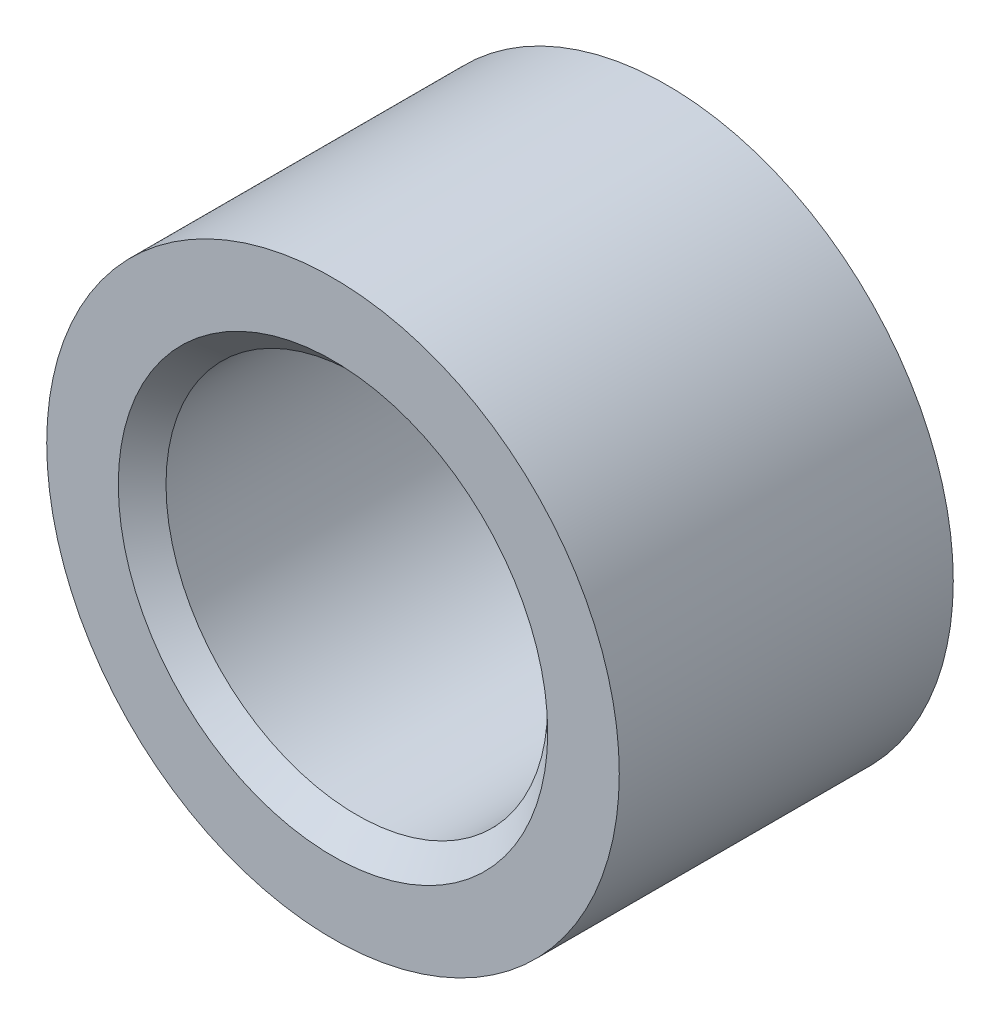
ISO-10303-21;
HEADER;
FILE_DESCRIPTION(('STEP AP214'),'2;1');
FILE_NAME('part.step','',(''),(''),'','','');
FILE_SCHEMA(('AUTOMOTIVE_DESIGN { 1 0 10303 214 1 1 1 1 }'));
ENDSEC;
DATA;
#1=APPLICATION_CONTEXT('core data for automotive mechanical design processes');
#2=APPLICATION_PROTOCOL_DEFINITION('international standard','automotive_design',2000,#1);
#3=PRODUCT_CONTEXT('',#1,'mechanical');
#4=PRODUCT('Part','Part','',(#3));
#5=PRODUCT_RELATED_PRODUCT_CATEGORY('part','',(#4));
#6=PRODUCT_DEFINITION_FORMATION('','',#4);
#7=PRODUCT_DEFINITION_CONTEXT('part definition',#1,'design');
#8=PRODUCT_DEFINITION('design','',#6,#7);
#9=PRODUCT_DEFINITION_SHAPE('','',#8);
#10=(LENGTH_UNIT() NAMED_UNIT(*) SI_UNIT(.MILLI.,.METRE.));
#11=(NAMED_UNIT(*) PLANE_ANGLE_UNIT() SI_UNIT($,.RADIAN.));
#12=(NAMED_UNIT(*) SI_UNIT($,.STERADIAN.) SOLID_ANGLE_UNIT());
#13=UNCERTAINTY_MEASURE_WITH_UNIT(LENGTH_MEASURE(1.E-05),#10,'distance_accuracy_value','');
#14=(GEOMETRIC_REPRESENTATION_CONTEXT(3) GLOBAL_UNCERTAINTY_ASSIGNED_CONTEXT((#13)) GLOBAL_UNIT_ASSIGNED_CONTEXT((#10,
#11,#12)) REPRESENTATION_CONTEXT('',''));
#15=CARTESIAN_POINT('',(0.,0.,0.));
#16=DIRECTION('',(0.,0.,1.));
#17=DIRECTION('',(1.,0.,0.));
#18=AXIS2_PLACEMENT_3D('',#15,#16,#17);
#19=CARTESIAN_POINT('',(0.,0.,3.5));
#20=DIRECTION('',(0.,0.,1.));
#21=DIRECTION('',(1.,0.,0.));
#22=AXIS2_PLACEMENT_3D('',#19,#20,#21);
#23=PLANE('',#22);
#24=CARTESIAN_POINT('',(0.,0.,3.5));
#25=DIRECTION('',(0.,0.,1.));
#26=DIRECTION('',(1.,0.,0.));
#27=AXIS2_PLACEMENT_3D('',#24,#25,#26);
#28=CIRCLE('',#27,4.5);
#29=CARTESIAN_POINT('',(4.5,0.,3.5));
#30=VERTEX_POINT('',#29);
#31=EDGE_CURVE('E10',#30,#30,#28,.F.);
#32=ORIENTED_EDGE('',*,*,#31,.T.);
#33=EDGE_LOOP('',(#32));
#34=FACE_BOUND('',#33,.T.);
#35=CARTESIAN_POINT('',(0.,0.,3.5));
#36=DIRECTION('',(0.,0.,1.));
#37=DIRECTION('',(1.,0.,0.));
#38=AXIS2_PLACEMENT_3D('',#35,#36,#37);
#39=CIRCLE('',#38,6.);
#40=CARTESIAN_POINT('',(6.,0.,3.5));
#41=VERTEX_POINT('',#40);
#42=EDGE_CURVE('E60',#41,#41,#39,.T.);
#43=ORIENTED_EDGE('',*,*,#42,.T.);
#44=EDGE_LOOP('',(#43));
#45=FACE_BOUND('',#44,.T.);
#46=ADVANCED_FACE('F39',(#34,#45),#23,.T.);
#47=CARTESIAN_POINT('',(0.,0.,-3.5));
#48=DIRECTION('',(0.,0.,1.));
#49=DIRECTION('',(1.,0.,0.));
#50=AXIS2_PLACEMENT_3D('',#47,#48,#49);
#51=PLANE('',#50);
#52=CARTESIAN_POINT('',(0.,0.,-3.5));
#53=DIRECTION('',(0.,0.,1.));
#54=DIRECTION('',(1.,0.,0.));
#55=AXIS2_PLACEMENT_3D('',#52,#53,#54);
#56=CIRCLE('',#55,4.5);
#57=CARTESIAN_POINT('',(4.5,0.,-3.5));
#58=VERTEX_POINT('',#57);
#59=EDGE_CURVE('E55',#58,#58,#56,.T.);
#60=ORIENTED_EDGE('',*,*,#59,.T.);
#61=EDGE_LOOP('',(#60));
#62=FACE_BOUND('',#61,.T.);
#63=CARTESIAN_POINT('',(0.,0.,-3.5));
#64=DIRECTION('',(0.,0.,1.));
#65=DIRECTION('',(1.,0.,0.));
#66=AXIS2_PLACEMENT_3D('',#63,#64,#65);
#67=CIRCLE('',#66,6.);
#68=CARTESIAN_POINT('',(6.,0.,-3.5));
#69=VERTEX_POINT('',#68);
#70=EDGE_CURVE('E61',#69,#69,#67,.T.);
#71=ORIENTED_EDGE('',*,*,#70,.F.);
#72=EDGE_LOOP('',(#71));
#73=FACE_BOUND('',#72,.T.);
#74=ADVANCED_FACE('F72',(#62,#73),#51,.F.);
#75=CARTESIAN_POINT('',(0.,0.,3.5));
#76=DIRECTION('',(0.,0.,-1.));
#77=DIRECTION('',(-1.,0.,0.));
#78=AXIS2_PLACEMENT_3D('',#75,#76,#77);
#79=CYLINDRICAL_SURFACE('',#78,6.);
#80=ORIENTED_EDGE('',*,*,#42,.F.);
#81=EDGE_LOOP('',(#80));
#82=FACE_BOUND('',#81,.T.);
#83=ORIENTED_EDGE('',*,*,#70,.T.);
#84=EDGE_LOOP('',(#83));
#85=FACE_BOUND('',#84,.T.);
#86=ADVANCED_FACE('F68',(#82,#85),#79,.T.);
#87=CARTESIAN_POINT('',(0.,0.,3.5));
#88=DIRECTION('',(0.,0.,-1.));
#89=DIRECTION('',(-1.,0.,0.));
#90=AXIS2_PLACEMENT_3D('',#87,#88,#89);
#91=CYLINDRICAL_SURFACE('',#90,4.);
#92=CARTESIAN_POINT('',(0.,0.,-3.));
#93=DIRECTION('',(0.,0.,1.));
#94=DIRECTION('',(1.,0.,0.));
#95=AXIS2_PLACEMENT_3D('',#92,#93,#94);
#96=CIRCLE('',#95,4.);
#97=CARTESIAN_POINT('',(4.,0.,-3.));
#98=VERTEX_POINT('',#97);
#99=EDGE_CURVE('E47',#98,#98,#96,.F.);
#100=ORIENTED_EDGE('',*,*,#99,.T.);
#101=EDGE_LOOP('',(#100));
#102=FACE_BOUND('',#101,.T.);
#103=CARTESIAN_POINT('',(0.,0.,3.));
#104=DIRECTION('',(0.,0.,1.));
#105=DIRECTION('',(1.,0.,0.));
#106=AXIS2_PLACEMENT_3D('',#103,#104,#105);
#107=CIRCLE('',#106,4.);
#108=CARTESIAN_POINT('',(4.,0.,3.));
#109=VERTEX_POINT('',#108);
#110=EDGE_CURVE('E51',#109,#109,#107,.T.);
#111=ORIENTED_EDGE('',*,*,#110,.T.);
#112=EDGE_LOOP('',(#111));
#113=FACE_BOUND('',#112,.T.);
#114=ADVANCED_FACE('F71',(#102,#113),#91,.F.);
#115=CARTESIAN_POINT('',(0.,0.,-3.5));
#116=DIRECTION('',(0.,0.,-1.));
#117=DIRECTION('',(-1.,0.,0.));
#118=AXIS2_PLACEMENT_3D('',#115,#116,#117);
#119=CONICAL_SURFACE('',#118,4.5,0.785398163397447);
#120=ORIENTED_EDGE('',*,*,#99,.F.);
#121=EDGE_LOOP('',(#120));
#122=FACE_BOUND('',#121,.T.);
#123=ORIENTED_EDGE('',*,*,#59,.F.);
#124=EDGE_LOOP('',(#123));
#125=FACE_BOUND('',#124,.T.);
#126=ADVANCED_FACE('F86',(#122,#125),#119,.F.);
#127=CARTESIAN_POINT('',(0.,0.,3.));
#128=DIRECTION('',(0.,0.,1.));
#129=DIRECTION('',(1.,0.,0.));
#130=AXIS2_PLACEMENT_3D('',#127,#128,#129);
#131=CONICAL_SURFACE('',#130,4.,0.785398163397448);
#132=ORIENTED_EDGE('',*,*,#31,.F.);
#133=EDGE_LOOP('',(#132));
#134=FACE_BOUND('',#133,.T.);
#135=ORIENTED_EDGE('',*,*,#110,.F.);
#136=EDGE_LOOP('',(#135));
#137=FACE_BOUND('',#136,.T.);
#138=ADVANCED_FACE('F42',(#134,#137),#131,.F.);
#139=CLOSED_SHELL('',(#46,#74,#86,#114,#126,#138));
#140=MANIFOLD_SOLID_BREP('B2',#139);
#141=ADVANCED_BREP_SHAPE_REPRESENTATION('',(#18,#140),#14);
#142=SHAPE_DEFINITION_REPRESENTATION(#9,#141);
ENDSEC;
END-ISO-10303-21;
